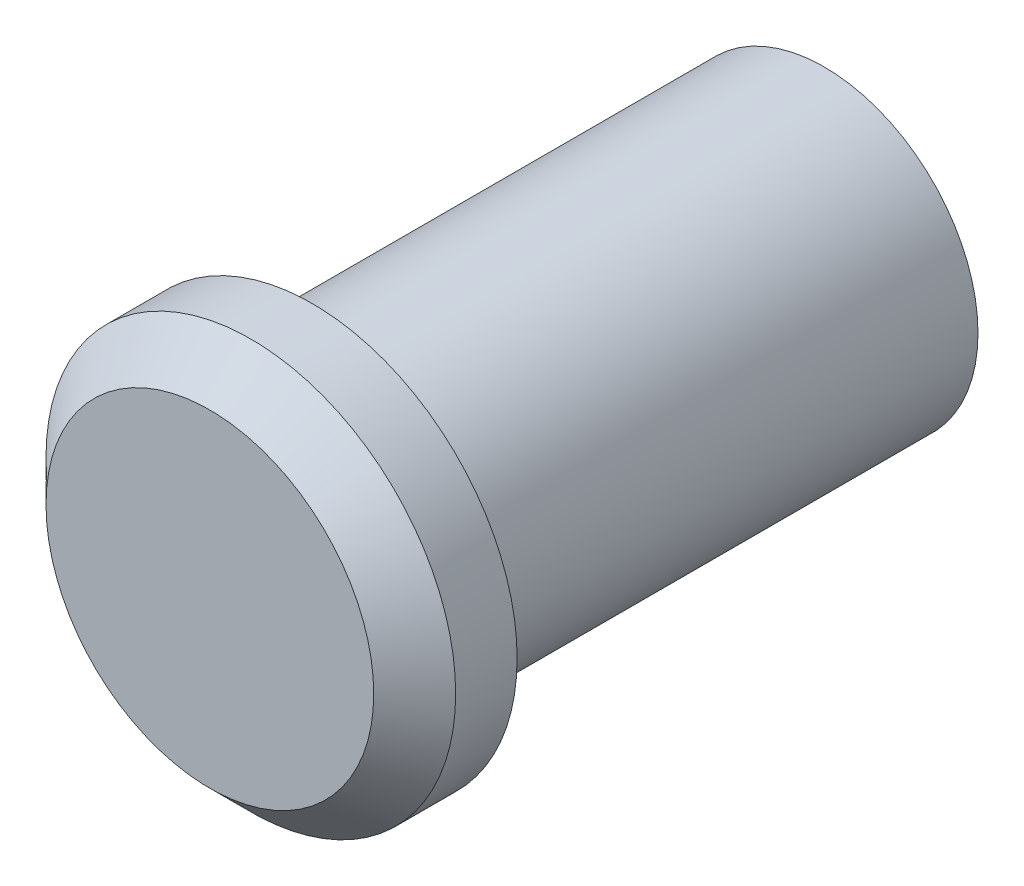
ISO-10303-21;
HEADER;
FILE_DESCRIPTION(('STEP AP214'),'2;1');
FILE_NAME('part.step','',(''),(''),'','','');
FILE_SCHEMA(('AUTOMOTIVE_DESIGN { 1 0 10303 214 1 1 1 1 }'));
ENDSEC;
DATA;
#1=APPLICATION_CONTEXT('core data for automotive mechanical design processes');
#2=APPLICATION_PROTOCOL_DEFINITION('international standard','automotive_design',2000,#1);
#3=PRODUCT_CONTEXT('',#1,'mechanical');
#4=PRODUCT('Part','Part','',(#3));
#5=PRODUCT_RELATED_PRODUCT_CATEGORY('part','',(#4));
#6=PRODUCT_DEFINITION_FORMATION('','',#4);
#7=PRODUCT_DEFINITION_CONTEXT('part definition',#1,'design');
#8=PRODUCT_DEFINITION('design','',#6,#7);
#9=PRODUCT_DEFINITION_SHAPE('','',#8);
#10=(LENGTH_UNIT() NAMED_UNIT(*) SI_UNIT(.MILLI.,.METRE.));
#11=(NAMED_UNIT(*) PLANE_ANGLE_UNIT() SI_UNIT($,.RADIAN.));
#12=(NAMED_UNIT(*) SI_UNIT($,.STERADIAN.) SOLID_ANGLE_UNIT());
#13=UNCERTAINTY_MEASURE_WITH_UNIT(LENGTH_MEASURE(1.E-05),#10,'distance_accuracy_value','');
#14=(GEOMETRIC_REPRESENTATION_CONTEXT(3) GLOBAL_UNCERTAINTY_ASSIGNED_CONTEXT((#13)) GLOBAL_UNIT_ASSIGNED_CONTEXT((#10,
#11,#12)) REPRESENTATION_CONTEXT('',''));
#15=CARTESIAN_POINT('',(0.,0.,0.));
#16=DIRECTION('',(0.,0.,1.));
#17=DIRECTION('',(1.,0.,0.));
#18=AXIS2_PLACEMENT_3D('',#15,#16,#17);
#19=CARTESIAN_POINT('',(0.,0.,25.));
#20=DIRECTION('',(0.,0.,-1.));
#21=DIRECTION('',(-1.,0.,0.));
#22=AXIS2_PLACEMENT_3D('',#19,#20,#21);
#23=CYLINDRICAL_SURFACE('',#22,7.5);
#24=CARTESIAN_POINT('',(0.,0.,25.));
#25=DIRECTION('',(0.,0.,1.));
#26=DIRECTION('',(1.,0.,0.));
#27=AXIS2_PLACEMENT_3D('',#24,#25,#26);
#28=CIRCLE('',#27,7.5);
#29=CARTESIAN_POINT('',(7.5,0.,25.));
#30=VERTEX_POINT('',#29);
#31=EDGE_CURVE('E52',#30,#30,#28,.T.);
#32=ORIENTED_EDGE('',*,*,#31,.F.);
#33=EDGE_LOOP('',(#32));
#34=FACE_BOUND('',#33,.T.);
#35=CARTESIAN_POINT('',(0.,0.,0.));
#36=DIRECTION('',(0.,0.,1.));
#37=DIRECTION('',(1.,0.,0.));
#38=AXIS2_PLACEMENT_3D('',#35,#36,#37);
#39=CIRCLE('',#38,7.5);
#40=CARTESIAN_POINT('',(7.5,0.,0.));
#41=VERTEX_POINT('',#40);
#42=EDGE_CURVE('E57',#41,#41,#39,.T.);
#43=ORIENTED_EDGE('',*,*,#42,.T.);
#44=EDGE_LOOP('',(#43));
#45=FACE_BOUND('',#44,.T.);
#46=ADVANCED_FACE('F38',(#34,#45),#23,.T.);
#47=CARTESIAN_POINT('',(0.,0.,0.));
#48=DIRECTION('',(0.,0.,1.));
#49=DIRECTION('',(1.,0.,0.));
#50=AXIS2_PLACEMENT_3D('',#47,#48,#49);
#51=PLANE('',#50);
#52=CARTESIAN_POINT('',(0.,0.,0.));
#53=DIRECTION('',(0.,0.,-1.));
#54=DIRECTION('',(-1.,0.,0.));
#55=AXIS2_PLACEMENT_3D('',#52,#53,#54);
#56=CIRCLE('',#55,1.5);
#57=CARTESIAN_POINT('',(-1.5,0.,0.));
#58=VERTEX_POINT('',#57);
#59=EDGE_CURVE('E68',#58,#58,#56,.T.);
#60=ORIENTED_EDGE('',*,*,#59,.F.);
#61=EDGE_LOOP('',(#60));
#62=FACE_BOUND('',#61,.T.);
#63=ORIENTED_EDGE('',*,*,#42,.F.);
#64=EDGE_LOOP('',(#63));
#65=FACE_BOUND('',#64,.T.);
#66=ADVANCED_FACE('F85',(#62,#65),#51,.F.);
#67=CARTESIAN_POINT('',(0.,0.,30.));
#68=DIRECTION('',(0.,0.,-1.));
#69=DIRECTION('',(-1.,0.,0.));
#70=AXIS2_PLACEMENT_3D('',#67,#68,#69);
#71=CYLINDRICAL_SURFACE('',#70,10.);
#72=CARTESIAN_POINT('',(0.,0.,28.));
#73=DIRECTION('',(0.,0.,1.));
#74=DIRECTION('',(1.,0.,0.));
#75=AXIS2_PLACEMENT_3D('',#72,#73,#74);
#76=CIRCLE('',#75,10.);
#77=CARTESIAN_POINT('',(10.,0.,28.));
#78=VERTEX_POINT('',#77);
#79=EDGE_CURVE('E10',#78,#78,#76,.F.);
#80=ORIENTED_EDGE('',*,*,#79,.T.);
#81=EDGE_LOOP('',(#80));
#82=FACE_BOUND('',#81,.T.);
#83=CARTESIAN_POINT('',(0.,0.,25.));
#84=DIRECTION('',(0.,0.,1.));
#85=DIRECTION('',(1.,0.,0.));
#86=AXIS2_PLACEMENT_3D('',#83,#84,#85);
#87=CIRCLE('',#86,10.);
#88=CARTESIAN_POINT('',(10.,0.,25.));
#89=VERTEX_POINT('',#88);
#90=EDGE_CURVE('E62',#89,#89,#87,.T.);
#91=ORIENTED_EDGE('',*,*,#90,.T.);
#92=EDGE_LOOP('',(#91));
#93=FACE_BOUND('',#92,.T.);
#94=ADVANCED_FACE('F88',(#82,#93),#71,.T.);
#95=CARTESIAN_POINT('',(0.,0.,30.));
#96=DIRECTION('',(0.,0.,1.));
#97=DIRECTION('',(1.,0.,0.));
#98=AXIS2_PLACEMENT_3D('',#95,#96,#97);
#99=PLANE('',#98);
#100=CARTESIAN_POINT('',(0.,0.,30.));
#101=DIRECTION('',(0.,0.,1.));
#102=DIRECTION('',(1.,0.,0.));
#103=AXIS2_PLACEMENT_3D('',#100,#101,#102);
#104=CIRCLE('',#103,8.);
#105=CARTESIAN_POINT('',(8.,0.,30.));
#106=VERTEX_POINT('',#105);
#107=EDGE_CURVE('E47',#106,#106,#104,.T.);
#108=ORIENTED_EDGE('',*,*,#107,.T.);
#109=EDGE_LOOP('',(#108));
#110=FACE_BOUND('',#109,.T.);
#111=ADVANCED_FACE('F100',(#110),#99,.T.);
#112=CARTESIAN_POINT('',(0.,0.,25.));
#113=DIRECTION('',(0.,0.,1.));
#114=DIRECTION('',(1.,0.,0.));
#115=AXIS2_PLACEMENT_3D('',#112,#113,#114);
#116=PLANE('',#115);
#117=ORIENTED_EDGE('',*,*,#31,.T.);
#118=EDGE_LOOP('',(#117));
#119=FACE_BOUND('',#118,.T.);
#120=ORIENTED_EDGE('',*,*,#90,.F.);
#121=EDGE_LOOP('',(#120));
#122=FACE_BOUND('',#121,.T.);
#123=ADVANCED_FACE('F81',(#119,#122),#116,.F.);
#124=CARTESIAN_POINT('',(0.,0.,5.));
#125=DIRECTION('',(0.,0.,-1.));
#126=DIRECTION('',(-1.,0.,0.));
#127=AXIS2_PLACEMENT_3D('',#124,#125,#126);
#128=CYLINDRICAL_SURFACE('',#127,1.5);
#129=CARTESIAN_POINT('',(0.,0.,5.));
#130=DIRECTION('',(0.,0.,-1.));
#131=DIRECTION('',(-1.,0.,0.));
#132=AXIS2_PLACEMENT_3D('',#129,#130,#131);
#133=CIRCLE('',#132,1.5);
#134=CARTESIAN_POINT('',(-1.5,0.,5.));
#135=VERTEX_POINT('',#134);
#136=EDGE_CURVE('E67',#135,#135,#133,.T.);
#137=ORIENTED_EDGE('',*,*,#136,.F.);
#138=EDGE_LOOP('',(#137));
#139=FACE_BOUND('',#138,.T.);
#140=ORIENTED_EDGE('',*,*,#59,.T.);
#141=EDGE_LOOP('',(#140));
#142=FACE_BOUND('',#141,.T.);
#143=ADVANCED_FACE('F78',(#139,#142),#128,.F.);
#144=CARTESIAN_POINT('',(0.,0.,5.));
#145=DIRECTION('',(0.,0.,-1.));
#146=DIRECTION('',(-1.,0.,0.));
#147=AXIS2_PLACEMENT_3D('',#144,#145,#146);
#148=PLANE('',#147);
#149=ORIENTED_EDGE('',*,*,#136,.T.);
#150=EDGE_LOOP('',(#149));
#151=FACE_BOUND('',#150,.T.);
#152=ADVANCED_FACE('F76',(#151),#148,.T.);
#153=CARTESIAN_POINT('',(0.,0.,30.));
#154=DIRECTION('',(0.,0.,-1.));
#155=DIRECTION('',(-1.,0.,0.));
#156=AXIS2_PLACEMENT_3D('',#153,#154,#155);
#157=CONICAL_SURFACE('',#156,8.,0.785398163397445);
#158=ORIENTED_EDGE('',*,*,#79,.F.);
#159=EDGE_LOOP('',(#158));
#160=FACE_BOUND('',#159,.T.);
#161=ORIENTED_EDGE('',*,*,#107,.F.);
#162=EDGE_LOOP('',(#161));
#163=FACE_BOUND('',#162,.T.);
#164=ADVANCED_FACE('F41',(#160,#163),#157,.T.);
#165=CLOSED_SHELL('',(#46,#66,#94,#111,#123,#143,#152,#164));
#166=MANIFOLD_SOLID_BREP('B2',#165);
#167=ADVANCED_BREP_SHAPE_REPRESENTATION('',(#18,#166),#14);
#168=SHAPE_DEFINITION_REPRESENTATION(#9,#167);
ENDSEC;
END-ISO-10303-21;
